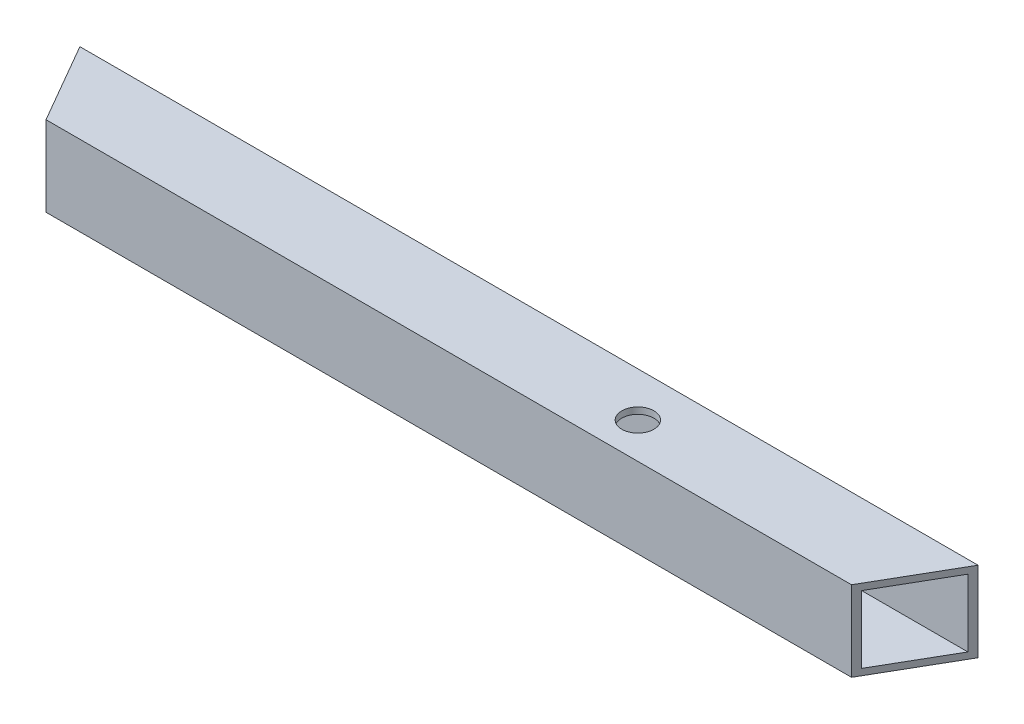
ISO-10303-21;
HEADER;
FILE_DESCRIPTION(('STEP AP214'),'2;1');
FILE_NAME('part.step','',(''),(''),'','','');
FILE_SCHEMA(('AUTOMOTIVE_DESIGN { 1 0 10303 214 1 1 1 1 }'));
ENDSEC;
DATA;
#1=APPLICATION_CONTEXT('core data for automotive mechanical design processes');
#2=APPLICATION_PROTOCOL_DEFINITION('international standard','automotive_design',2000,#1);
#3=PRODUCT_CONTEXT('',#1,'mechanical');
#4=PRODUCT('Part','Part','',(#3));
#5=PRODUCT_RELATED_PRODUCT_CATEGORY('part','',(#4));
#6=PRODUCT_DEFINITION_FORMATION('','',#4);
#7=PRODUCT_DEFINITION_CONTEXT('part definition',#1,'design');
#8=PRODUCT_DEFINITION('design','',#6,#7);
#9=PRODUCT_DEFINITION_SHAPE('','',#8);
#10=(LENGTH_UNIT() NAMED_UNIT(*) SI_UNIT(.MILLI.,.METRE.));
#11=(NAMED_UNIT(*) PLANE_ANGLE_UNIT() SI_UNIT($,.RADIAN.));
#12=(NAMED_UNIT(*) SI_UNIT($,.STERADIAN.) SOLID_ANGLE_UNIT());
#13=UNCERTAINTY_MEASURE_WITH_UNIT(LENGTH_MEASURE(1.E-05),#10,'distance_accuracy_value','');
#14=(GEOMETRIC_REPRESENTATION_CONTEXT(3) GLOBAL_UNCERTAINTY_ASSIGNED_CONTEXT((#13)) GLOBAL_UNIT_ASSIGNED_CONTEXT((#10,
#11,#12)) REPRESENTATION_CONTEXT('',''));
#15=CARTESIAN_POINT('',(0.,0.,0.));
#16=DIRECTION('',(0.,0.,1.));
#17=DIRECTION('',(1.,0.,0.));
#18=AXIS2_PLACEMENT_3D('',#15,#16,#17);
#19=CARTESIAN_POINT('',(125.566243270259,25.,-217.487113059643));
#20=DIRECTION('',(-0.866025403784443,0.,-0.499999999999992));
#21=DIRECTION('',(-0.499999999999992,0.,0.866025403784444));
#22=AXIS2_PLACEMENT_3D('',#19,#20,#21);
#23=PLANE('',#22);
#24=DIRECTION('',(0.499999999999992,0.,-0.866025403784443));
#25=VECTOR('',#24,1.);
#26=CARTESIAN_POINT('',(125.566243270259,0.,-217.487113059643));
#27=LINE('',#26,#25);
#28=CARTESIAN_POINT('',(125.566243270259,0.,-217.487113059643));
#29=VERTEX_POINT('',#28);
#30=CARTESIAN_POINT('',(139.999999999999,0.,-242.487113059643));
#31=VERTEX_POINT('',#30);
#32=EDGE_CURVE('E127',#29,#31,#27,.T.);
#33=ORIENTED_EDGE('',*,*,#32,.T.);
#34=DIRECTION('',(0.,-1.,0.));
#35=VECTOR('',#34,1.);
#36=CARTESIAN_POINT('',(139.999999999999,25.,-242.487113059643));
#37=LINE('',#36,#35);
#38=CARTESIAN_POINT('',(139.999999999999,25.,-242.487113059643));
#39=VERTEX_POINT('',#38);
#40=EDGE_CURVE('E11',#39,#31,#37,.T.);
#41=ORIENTED_EDGE('',*,*,#40,.F.);
#42=DIRECTION('',(0.499999999999992,0.,-0.866025403784443));
#43=VECTOR('',#42,1.);
#44=CARTESIAN_POINT('',(125.566243270259,25.,-217.487113059643));
#45=LINE('',#44,#43);
#46=CARTESIAN_POINT('',(125.566243270259,25.,-217.487113059643));
#47=VERTEX_POINT('',#46);
#48=EDGE_CURVE('E133',#47,#39,#45,.T.);
#49=ORIENTED_EDGE('',*,*,#48,.F.);
#50=DIRECTION('',(0.,-1.,0.));
#51=VECTOR('',#50,1.);
#52=CARTESIAN_POINT('',(125.566243270259,25.,-217.487113059643));
#53=LINE('',#52,#51);
#54=EDGE_CURVE('E143',#47,#29,#53,.T.);
#55=ORIENTED_EDGE('',*,*,#54,.T.);
#56=EDGE_LOOP('',(#33,#41,#49,#55));
#57=FACE_BOUND('',#56,.T.);
#58=DIRECTION('',(0.499999999999992,0.,-0.866025403784444));
#59=VECTOR('',#58,1.);
#60=CARTESIAN_POINT('',(125.566243270259,2.,-217.487113059643));
#61=LINE('',#60,#59);
#62=CARTESIAN_POINT('',(126.720943808638,2.,-219.487113059643));
#63=VERTEX_POINT('',#62);
#64=CARTESIAN_POINT('',(138.84529946162,2.,-240.487113059643));
#65=VERTEX_POINT('',#64);
#66=EDGE_CURVE('E103',#63,#65,#61,.T.);
#67=ORIENTED_EDGE('',*,*,#66,.F.);
#68=DIRECTION('',(0.,-1.,0.));
#69=VECTOR('',#68,1.);
#70=CARTESIAN_POINT('',(126.720943808638,25.,-219.487113059643));
#71=LINE('',#70,#69);
#72=CARTESIAN_POINT('',(126.720943808638,23.,-219.487113059643));
#73=VERTEX_POINT('',#72);
#74=EDGE_CURVE('E123',#73,#63,#71,.T.);
#75=ORIENTED_EDGE('',*,*,#74,.F.);
#76=DIRECTION('',(0.499999999999992,0.,-0.866025403784444));
#77=VECTOR('',#76,1.);
#78=CARTESIAN_POINT('',(125.566243270259,23.,-217.487113059643));
#79=LINE('',#78,#77);
#80=CARTESIAN_POINT('',(138.84529946162,23.,-240.487113059643));
#81=VERTEX_POINT('',#80);
#82=EDGE_CURVE('E47',#73,#81,#79,.T.);
#83=ORIENTED_EDGE('',*,*,#82,.T.);
#84=DIRECTION('',(0.,-1.,0.));
#85=VECTOR('',#84,1.);
#86=CARTESIAN_POINT('',(138.84529946162,25.,-240.487113059643));
#87=LINE('',#86,#85);
#88=EDGE_CURVE('E113',#81,#65,#87,.T.);
#89=ORIENTED_EDGE('',*,*,#88,.T.);
#90=EDGE_LOOP('',(#67,#75,#83,#89));
#91=FACE_BOUND('',#90,.T.);
#92=ADVANCED_FACE('F32',(#57,#91),#23,.F.);
#93=CARTESIAN_POINT('',(-140.000000000001,25.,-242.487113059642));
#94=DIRECTION('',(0.866025403784421,0.,-0.50000000000003));
#95=DIRECTION('',(-0.50000000000003,0.,-0.866025403784421));
#96=AXIS2_PLACEMENT_3D('',#93,#94,#95);
#97=PLANE('',#96);
#98=DIRECTION('',(0.50000000000003,0.,0.866025403784421));
#99=VECTOR('',#98,1.);
#100=CARTESIAN_POINT('',(-140.000000000001,0.,-242.487113059642));
#101=LINE('',#100,#99);
#102=CARTESIAN_POINT('',(-140.000000000001,0.,-242.487113059642));
#103=VERTEX_POINT('',#102);
#104=CARTESIAN_POINT('',(-125.56624327026,0.,-217.487113059643));
#105=VERTEX_POINT('',#104);
#106=EDGE_CURVE('E148',#103,#105,#101,.T.);
#107=ORIENTED_EDGE('',*,*,#106,.T.);
#108=DIRECTION('',(0.,-1.,0.));
#109=VECTOR('',#108,1.);
#110=CARTESIAN_POINT('',(-125.56624327026,25.,-217.487113059643));
#111=LINE('',#110,#109);
#112=CARTESIAN_POINT('',(-125.56624327026,25.,-217.487113059643));
#113=VERTEX_POINT('',#112);
#114=EDGE_CURVE('E153',#113,#105,#111,.T.);
#115=ORIENTED_EDGE('',*,*,#114,.F.);
#116=DIRECTION('',(0.50000000000003,0.,0.866025403784421));
#117=VECTOR('',#116,1.);
#118=CARTESIAN_POINT('',(-140.000000000001,25.,-242.487113059642));
#119=LINE('',#118,#117);
#120=CARTESIAN_POINT('',(-140.000000000001,25.,-242.487113059642));
#121=VERTEX_POINT('',#120);
#122=EDGE_CURVE('E139',#121,#113,#119,.T.);
#123=ORIENTED_EDGE('',*,*,#122,.F.);
#124=DIRECTION('',(0.,-1.,0.));
#125=VECTOR('',#124,1.);
#126=CARTESIAN_POINT('',(-140.000000000001,25.,-242.487113059642));
#127=LINE('',#126,#125);
#128=EDGE_CURVE('E40',#121,#103,#127,.T.);
#129=ORIENTED_EDGE('',*,*,#128,.T.);
#130=EDGE_LOOP('',(#107,#115,#123,#129));
#131=FACE_BOUND('',#130,.T.);
#132=DIRECTION('',(0.50000000000003,0.,0.866025403784421));
#133=VECTOR('',#132,1.);
#134=CARTESIAN_POINT('',(-140.000000000001,2.,-242.487113059642));
#135=LINE('',#134,#133);
#136=CARTESIAN_POINT('',(-138.845299461621,2.,-240.487113059642));
#137=VERTEX_POINT('',#136);
#138=CARTESIAN_POINT('',(-126.720943808639,2.,-219.487113059643));
#139=VERTEX_POINT('',#138);
#140=EDGE_CURVE('E100',#137,#139,#135,.T.);
#141=ORIENTED_EDGE('',*,*,#140,.F.);
#142=DIRECTION('',(0.,-1.,0.));
#143=VECTOR('',#142,1.);
#144=CARTESIAN_POINT('',(-138.845299461621,25.,-240.487113059642));
#145=LINE('',#144,#143);
#146=CARTESIAN_POINT('',(-138.845299461621,23.,-240.487113059642));
#147=VERTEX_POINT('',#146);
#148=EDGE_CURVE('E109',#147,#137,#145,.T.);
#149=ORIENTED_EDGE('',*,*,#148,.F.);
#150=DIRECTION('',(0.50000000000003,0.,0.866025403784421));
#151=VECTOR('',#150,1.);
#152=CARTESIAN_POINT('',(-140.000000000001,23.,-242.487113059642));
#153=LINE('',#152,#151);
#154=CARTESIAN_POINT('',(-126.720943808639,23.,-219.487113059643));
#155=VERTEX_POINT('',#154);
#156=EDGE_CURVE('E52',#147,#155,#153,.T.);
#157=ORIENTED_EDGE('',*,*,#156,.T.);
#158=DIRECTION('',(0.,-1.,0.));
#159=VECTOR('',#158,1.);
#160=CARTESIAN_POINT('',(-126.720943808639,25.,-219.487113059643));
#161=LINE('',#160,#159);
#162=EDGE_CURVE('E114',#155,#139,#161,.T.);
#163=ORIENTED_EDGE('',*,*,#162,.T.);
#164=EDGE_LOOP('',(#141,#149,#157,#163));
#165=FACE_BOUND('',#164,.T.);
#166=ADVANCED_FACE('F117',(#131,#165),#97,.F.);
#167=CARTESIAN_POINT('',(139.999999999999,25.,-242.487113059643));
#168=DIRECTION('',(0.,0.,1.));
#169=DIRECTION('',(1.,0.,0.));
#170=AXIS2_PLACEMENT_3D('',#167,#168,#169);
#171=PLANE('',#170);
#172=DIRECTION('',(-1.,0.,0.));
#173=VECTOR('',#172,1.);
#174=CARTESIAN_POINT('',(139.999999999999,0.,-242.487113059643));
#175=LINE('',#174,#173);
#176=EDGE_CURVE('E146',#31,#103,#175,.T.);
#177=ORIENTED_EDGE('',*,*,#176,.T.);
#178=ORIENTED_EDGE('',*,*,#128,.F.);
#179=DIRECTION('',(-1.,0.,0.));
#180=VECTOR('',#179,1.);
#181=CARTESIAN_POINT('',(139.999999999999,25.,-242.487113059643));
#182=LINE('',#181,#180);
#183=EDGE_CURVE('E136',#39,#121,#182,.T.);
#184=ORIENTED_EDGE('',*,*,#183,.F.);
#185=ORIENTED_EDGE('',*,*,#40,.T.);
#186=EDGE_LOOP('',(#177,#178,#184,#185));
#187=FACE_BOUND('',#186,.T.);
#188=ADVANCED_FACE('F177',(#187),#171,.F.);
#189=CARTESIAN_POINT('',(125.566243270259,25.,-217.487113059643));
#190=DIRECTION('',(0.,0.,-1.));
#191=DIRECTION('',(-1.,0.,0.));
#192=AXIS2_PLACEMENT_3D('',#189,#190,#191);
#193=PLANE('',#192);
#194=DIRECTION('',(1.,0.,0.));
#195=VECTOR('',#194,1.);
#196=CARTESIAN_POINT('',(125.566243270259,0.,-217.487113059643));
#197=LINE('',#196,#195);
#198=EDGE_CURVE('E137',#105,#29,#197,.T.);
#199=ORIENTED_EDGE('',*,*,#198,.T.);
#200=ORIENTED_EDGE('',*,*,#54,.F.);
#201=DIRECTION('',(1.,0.,0.));
#202=VECTOR('',#201,1.);
#203=CARTESIAN_POINT('',(125.566243270259,25.,-217.487113059643));
#204=LINE('',#203,#202);
#205=EDGE_CURVE('E141',#113,#47,#204,.T.);
#206=ORIENTED_EDGE('',*,*,#205,.F.);
#207=ORIENTED_EDGE('',*,*,#114,.T.);
#208=EDGE_LOOP('',(#199,#200,#206,#207));
#209=FACE_BOUND('',#208,.T.);
#210=ADVANCED_FACE('F169',(#209),#193,.F.);
#211=CARTESIAN_POINT('',(0.,25.,0.));
#212=DIRECTION('',(0.,1.,0.));
#213=DIRECTION('',(0.,0.,1.));
#214=AXIS2_PLACEMENT_3D('',#211,#212,#213);
#215=PLANE('',#214);
#216=CARTESIAN_POINT('',(47.783121635129,25.,-228.657359562333));
#217=DIRECTION('',(0.,1.,0.));
#218=DIRECTION('',(0.,0.,1.));
#219=AXIS2_PLACEMENT_3D('',#216,#217,#218);
#220=CIRCLE('',#219,5.);
#221=CARTESIAN_POINT('',(47.783121635129,25.,-223.657359562333));
#222=VERTEX_POINT('',#221);
#223=EDGE_CURVE('E266',#222,#222,#220,.T.);
#224=ORIENTED_EDGE('',*,*,#223,.F.);
#225=EDGE_LOOP('',(#224));
#226=FACE_BOUND('',#225,.T.);
#227=ORIENTED_EDGE('',*,*,#48,.T.);
#228=ORIENTED_EDGE('',*,*,#183,.T.);
#229=ORIENTED_EDGE('',*,*,#122,.T.);
#230=ORIENTED_EDGE('',*,*,#205,.T.);
#231=EDGE_LOOP('',(#227,#228,#229,#230));
#232=FACE_BOUND('',#231,.T.);
#233=ADVANCED_FACE('F176',(#226,#232),#215,.T.);
#234=CARTESIAN_POINT('',(0.,0.,0.));
#235=DIRECTION('',(0.,1.,0.));
#236=DIRECTION('',(0.,0.,1.));
#237=AXIS2_PLACEMENT_3D('',#234,#235,#236);
#238=PLANE('',#237);
#239=CARTESIAN_POINT('',(47.783121635129,0.,-228.657359562333));
#240=DIRECTION('',(0.,1.,0.));
#241=DIRECTION('',(0.,0.,1.));
#242=AXIS2_PLACEMENT_3D('',#239,#240,#241);
#243=CIRCLE('',#242,5.);
#244=CARTESIAN_POINT('',(47.783121635129,0.,-223.657359562333));
#245=VERTEX_POINT('',#244);
#246=EDGE_CURVE('E132',#245,#245,#243,.T.);
#247=ORIENTED_EDGE('',*,*,#246,.T.);
#248=EDGE_LOOP('',(#247));
#249=FACE_BOUND('',#248,.T.);
#250=ORIENTED_EDGE('',*,*,#32,.F.);
#251=ORIENTED_EDGE('',*,*,#198,.F.);
#252=ORIENTED_EDGE('',*,*,#106,.F.);
#253=ORIENTED_EDGE('',*,*,#176,.F.);
#254=EDGE_LOOP('',(#250,#251,#252,#253));
#255=FACE_BOUND('',#254,.T.);
#256=ADVANCED_FACE('F166',(#249,#255),#238,.F.);
#257=CARTESIAN_POINT('',(139.999999999999,25.,-240.487113059643));
#258=DIRECTION('',(0.,0.,1.));
#259=DIRECTION('',(1.,0.,0.));
#260=AXIS2_PLACEMENT_3D('',#257,#258,#259);
#261=PLANE('',#260);
#262=DIRECTION('',(-1.,0.,0.));
#263=VECTOR('',#262,1.);
#264=CARTESIAN_POINT('',(139.999999999999,2.,-240.487113059643));
#265=LINE('',#264,#263);
#266=EDGE_CURVE('E96',#65,#137,#265,.T.);
#267=ORIENTED_EDGE('',*,*,#266,.F.);
#268=ORIENTED_EDGE('',*,*,#88,.F.);
#269=DIRECTION('',(-1.,0.,0.));
#270=VECTOR('',#269,1.);
#271=CARTESIAN_POINT('',(139.999999999999,23.,-240.487113059643));
#272=LINE('',#271,#270);
#273=EDGE_CURVE('E111',#81,#147,#272,.T.);
#274=ORIENTED_EDGE('',*,*,#273,.T.);
#275=ORIENTED_EDGE('',*,*,#148,.T.);
#276=EDGE_LOOP('',(#267,#268,#274,#275));
#277=FACE_BOUND('',#276,.T.);
#278=ADVANCED_FACE('F110',(#277),#261,.T.);
#279=CARTESIAN_POINT('',(125.566243270259,25.,-219.487113059643));
#280=DIRECTION('',(0.,0.,-1.));
#281=DIRECTION('',(-1.,0.,0.));
#282=AXIS2_PLACEMENT_3D('',#279,#280,#281);
#283=PLANE('',#282);
#284=DIRECTION('',(1.,0.,0.));
#285=VECTOR('',#284,1.);
#286=CARTESIAN_POINT('',(125.566243270259,2.,-219.487113059643));
#287=LINE('',#286,#285);
#288=EDGE_CURVE('E118',#139,#63,#287,.T.);
#289=ORIENTED_EDGE('',*,*,#288,.F.);
#290=ORIENTED_EDGE('',*,*,#162,.F.);
#291=DIRECTION('',(1.,0.,0.));
#292=VECTOR('',#291,1.);
#293=CARTESIAN_POINT('',(125.566243270259,23.,-219.487113059643));
#294=LINE('',#293,#292);
#295=EDGE_CURVE('E125',#155,#73,#294,.T.);
#296=ORIENTED_EDGE('',*,*,#295,.T.);
#297=ORIENTED_EDGE('',*,*,#74,.T.);
#298=EDGE_LOOP('',(#289,#290,#296,#297));
#299=FACE_BOUND('',#298,.T.);
#300=ADVANCED_FACE('F203',(#299),#283,.T.);
#301=CARTESIAN_POINT('',(0.,23.,0.));
#302=DIRECTION('',(0.,1.,0.));
#303=DIRECTION('',(0.,0.,1.));
#304=AXIS2_PLACEMENT_3D('',#301,#302,#303);
#305=PLANE('',#304);
#306=CARTESIAN_POINT('',(47.783121635129,23.,-228.657359562333));
#307=DIRECTION('',(0.,1.,0.));
#308=DIRECTION('',(0.,0.,1.));
#309=AXIS2_PLACEMENT_3D('',#306,#307,#308);
#310=CIRCLE('',#309,5.);
#311=CARTESIAN_POINT('',(47.783121635129,23.,-223.657359562333));
#312=VERTEX_POINT('',#311);
#313=EDGE_CURVE('E269',#312,#312,#310,.T.);
#314=ORIENTED_EDGE('',*,*,#313,.T.);
#315=EDGE_LOOP('',(#314));
#316=FACE_BOUND('',#315,.T.);
#317=ORIENTED_EDGE('',*,*,#82,.F.);
#318=ORIENTED_EDGE('',*,*,#295,.F.);
#319=ORIENTED_EDGE('',*,*,#156,.F.);
#320=ORIENTED_EDGE('',*,*,#273,.F.);
#321=EDGE_LOOP('',(#317,#318,#319,#320));
#322=FACE_BOUND('',#321,.T.);
#323=ADVANCED_FACE('F213',(#316,#322),#305,.F.);
#324=CARTESIAN_POINT('',(0.,2.,0.));
#325=DIRECTION('',(0.,1.,0.));
#326=DIRECTION('',(0.,0.,1.));
#327=AXIS2_PLACEMENT_3D('',#324,#325,#326);
#328=PLANE('',#327);
#329=CARTESIAN_POINT('',(47.783121635129,2.,-228.657359562333));
#330=DIRECTION('',(0.,1.,0.));
#331=DIRECTION('',(0.,0.,1.));
#332=AXIS2_PLACEMENT_3D('',#329,#330,#331);
#333=CIRCLE('',#332,5.);
#334=CARTESIAN_POINT('',(47.783121635129,2.,-223.657359562333));
#335=VERTEX_POINT('',#334);
#336=EDGE_CURVE('E35',#335,#335,#333,.T.);
#337=ORIENTED_EDGE('',*,*,#336,.F.);
#338=EDGE_LOOP('',(#337));
#339=FACE_BOUND('',#338,.T.);
#340=ORIENTED_EDGE('',*,*,#66,.T.);
#341=ORIENTED_EDGE('',*,*,#266,.T.);
#342=ORIENTED_EDGE('',*,*,#140,.T.);
#343=ORIENTED_EDGE('',*,*,#288,.T.);
#344=EDGE_LOOP('',(#340,#341,#342,#343));
#345=FACE_BOUND('',#344,.T.);
#346=ADVANCED_FACE('F98',(#339,#345),#328,.T.);
#347=CARTESIAN_POINT('',(47.783121635129,-28.,-228.657359562333));
#348=DIRECTION('',(0.,1.,0.));
#349=DIRECTION('',(0.,0.,1.));
#350=AXIS2_PLACEMENT_3D('',#347,#348,#349);
#351=CYLINDRICAL_SURFACE('',#350,5.);
#352=ORIENTED_EDGE('',*,*,#336,.T.);
#353=EDGE_LOOP('',(#352));
#354=FACE_BOUND('',#353,.T.);
#355=ORIENTED_EDGE('',*,*,#246,.F.);
#356=EDGE_LOOP('',(#355));
#357=FACE_BOUND('',#356,.T.);
#358=ADVANCED_FACE('F241',(#354,#357),#351,.F.);
#359=ORIENTED_EDGE('',*,*,#223,.T.);
#360=EDGE_LOOP('',(#359));
#361=FACE_BOUND('',#360,.T.);
#362=ORIENTED_EDGE('',*,*,#313,.F.);
#363=EDGE_LOOP('',(#362));
#364=FACE_BOUND('',#363,.T.);
#365=ADVANCED_FACE('F250',(#361,#364),#351,.F.);
#366=CLOSED_SHELL('',(#92,#166,#188,#210,#233,#256,#278,#300,#323,#346,#358,#365));
#367=MANIFOLD_SOLID_BREP('B2',#366);
#368=ADVANCED_BREP_SHAPE_REPRESENTATION('',(#18,#367),#14);
#369=SHAPE_DEFINITION_REPRESENTATION(#9,#368);
ENDSEC;
END-ISO-10303-21;
